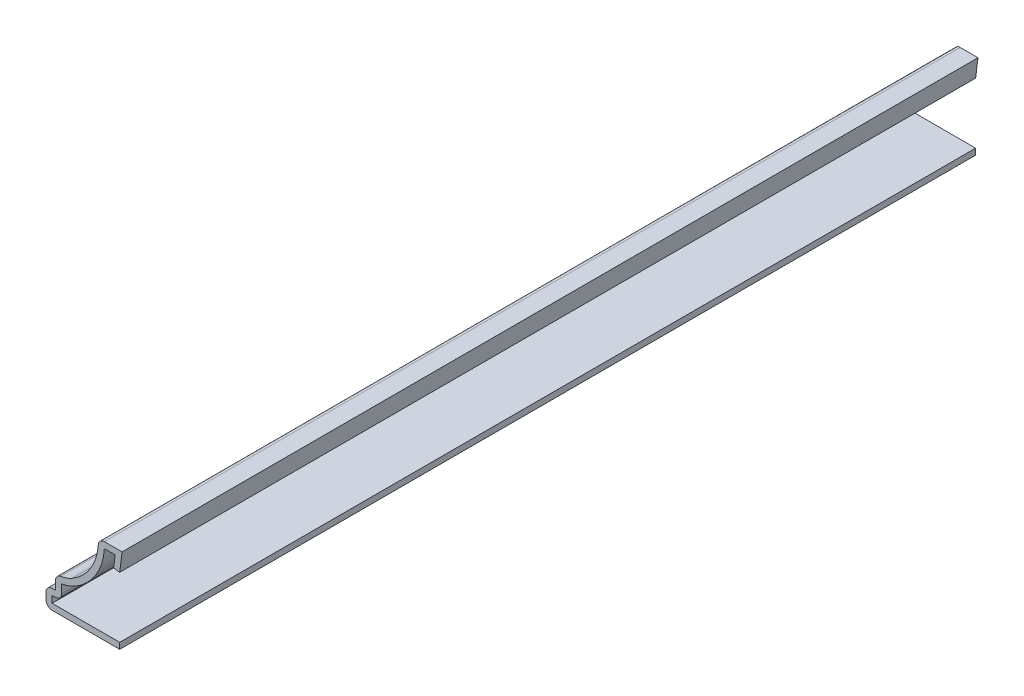
ISO-10303-21;
HEADER;
FILE_DESCRIPTION(('STEP AP214'),'2;1');
FILE_NAME('part.step','',(''),(''),'','','');
FILE_SCHEMA(('AUTOMOTIVE_DESIGN { 1 0 10303 214 1 1 1 1 }'));
ENDSEC;
DATA;
#1=APPLICATION_CONTEXT('core data for automotive mechanical design processes');
#2=APPLICATION_PROTOCOL_DEFINITION('international standard','automotive_design',2000,#1);
#3=PRODUCT_CONTEXT('',#1,'mechanical');
#4=PRODUCT('Part','Part','',(#3));
#5=PRODUCT_RELATED_PRODUCT_CATEGORY('part','',(#4));
#6=PRODUCT_DEFINITION_FORMATION('','',#4);
#7=PRODUCT_DEFINITION_CONTEXT('part definition',#1,'design');
#8=PRODUCT_DEFINITION('design','',#6,#7);
#9=PRODUCT_DEFINITION_SHAPE('','',#8);
#10=(LENGTH_UNIT() NAMED_UNIT(*) SI_UNIT(.MILLI.,.METRE.));
#11=(NAMED_UNIT(*) PLANE_ANGLE_UNIT() SI_UNIT($,.RADIAN.));
#12=(NAMED_UNIT(*) SI_UNIT($,.STERADIAN.) SOLID_ANGLE_UNIT());
#13=UNCERTAINTY_MEASURE_WITH_UNIT(LENGTH_MEASURE(1.E-05),#10,'distance_accuracy_value','');
#14=(GEOMETRIC_REPRESENTATION_CONTEXT(3) GLOBAL_UNCERTAINTY_ASSIGNED_CONTEXT((#13)) GLOBAL_UNIT_ASSIGNED_CONTEXT((#10,
#11,#12)) REPRESENTATION_CONTEXT('',''));
#15=CARTESIAN_POINT('',(0.,0.,0.));
#16=DIRECTION('',(0.,0.,1.));
#17=DIRECTION('',(1.,0.,0.));
#18=AXIS2_PLACEMENT_3D('',#15,#16,#17);
#19=CARTESIAN_POINT('',(-1.40490624951561,11.2644023452637,-142.875));
#20=DIRECTION('',(-0.992156741649221,0.125,0.));
#21=DIRECTION('',(-0.125,-0.992156741649222,0.));
#22=AXIS2_PLACEMENT_3D('',#19,#20,#21);
#23=PLANE('',#22);
#24=DIRECTION('',(-0.125,-0.992156741649221,0.));
#25=VECTOR('',#24,1.);
#26=CARTESIAN_POINT('',(-1.40490624951561,11.2644023452637,0.));
#27=LINE('',#26,#25);
#28=CARTESIAN_POINT('',(-1.15203571373212,13.2715,0.));
#29=VERTEX_POINT('',#28);
#30=CARTESIAN_POINT('',(-1.40490624951561,11.2644023452637,0.));
#31=VERTEX_POINT('',#30);
#32=EDGE_CURVE('E258',#29,#31,#27,.T.);
#33=ORIENTED_EDGE('',*,*,#32,.F.);
#34=DIRECTION('',(0.,0.,1.));
#35=VECTOR('',#34,1.);
#36=CARTESIAN_POINT('',(-1.15203571373212,13.2715,-142.875));
#37=LINE('',#36,#35);
#38=CARTESIAN_POINT('',(-1.15203571373212,13.2715,-142.875));
#39=VERTEX_POINT('',#38);
#40=EDGE_CURVE('E214',#39,#29,#37,.T.);
#41=ORIENTED_EDGE('',*,*,#40,.F.);
#42=DIRECTION('',(-0.125,-0.992156741649221,0.));
#43=VECTOR('',#42,1.);
#44=CARTESIAN_POINT('',(-1.40490624951561,11.2644023452637,-142.875));
#45=LINE('',#44,#43);
#46=CARTESIAN_POINT('',(-1.40490624951561,11.2644023452637,-142.875));
#47=VERTEX_POINT('',#46);
#48=EDGE_CURVE('E195',#39,#47,#45,.T.);
#49=ORIENTED_EDGE('',*,*,#48,.T.);
#50=DIRECTION('',(0.,0.,1.));
#51=VECTOR('',#50,1.);
#52=CARTESIAN_POINT('',(-1.40490624951561,11.2644023452637,-142.875));
#53=LINE('',#52,#51);
#54=EDGE_CURVE('E204',#47,#31,#53,.T.);
#55=ORIENTED_EDGE('',*,*,#54,.T.);
#56=EDGE_LOOP('',(#33,#41,#49,#55));
#57=FACE_BOUND('',#56,.T.);
#58=ADVANCED_FACE('F35',(#57),#23,.T.);
#59=CARTESIAN_POINT('',(0.,13.2715,-142.875));
#60=DIRECTION('',(0.,-1.,0.));
#61=DIRECTION('',(0.,0.,-1.));
#62=AXIS2_PLACEMENT_3D('',#59,#60,#61);
#63=PLANE('',#62);
#64=DIRECTION('',(1.,0.,0.));
#65=VECTOR('',#64,1.);
#66=CARTESIAN_POINT('',(0.,13.2715,0.));
#67=LINE('',#66,#65);
#68=CARTESIAN_POINT('',(-2.96092792350597,13.2715,0.));
#69=VERTEX_POINT('',#68);
#70=EDGE_CURVE('E215',#69,#29,#67,.T.);
#71=ORIENTED_EDGE('',*,*,#70,.F.);
#72=DIRECTION('',(0.,0.,1.));
#73=VECTOR('',#72,1.);
#74=CARTESIAN_POINT('',(-2.96092792350597,13.2715,-142.875));
#75=LINE('',#74,#73);
#76=CARTESIAN_POINT('',(-2.96092792350597,13.2715,-142.875));
#77=VERTEX_POINT('',#76);
#78=EDGE_CURVE('E300',#77,#69,#75,.T.);
#79=ORIENTED_EDGE('',*,*,#78,.F.);
#80=DIRECTION('',(1.,0.,0.));
#81=VECTOR('',#80,1.);
#82=CARTESIAN_POINT('',(0.,13.2715,-142.875));
#83=LINE('',#82,#81);
#84=EDGE_CURVE('E212',#77,#39,#83,.T.);
#85=ORIENTED_EDGE('',*,*,#84,.T.);
#86=ORIENTED_EDGE('',*,*,#40,.T.);
#87=EDGE_LOOP('',(#71,#79,#85,#86));
#88=FACE_BOUND('',#87,.T.);
#89=ADVANCED_FACE('F387',(#88),#63,.T.);
#90=CARTESIAN_POINT('',(-12.6899131848803,13.8679296659806,-142.875));
#91=DIRECTION('',(0.,0.,1.));
#92=DIRECTION('',(1.,0.,0.));
#93=AXIS2_PLACEMENT_3D('',#90,#91,#92);
#94=CYLINDRICAL_SURFACE('',#93,9.74725);
#95=CARTESIAN_POINT('',(-12.6899131848803,13.8679296659806,0.));
#96=DIRECTION('',(0.,0.,1.));
#97=DIRECTION('',(1.,0.,0.));
#98=AXIS2_PLACEMENT_3D('',#95,#96,#97);
#99=CIRCLE('',#98,9.74725);
#100=CARTESIAN_POINT('',(-7.84725470729787,5.40876059142018,0.));
#101=VERTEX_POINT('',#100);
#102=EDGE_CURVE('E218',#101,#69,#99,.T.);
#103=ORIENTED_EDGE('',*,*,#102,.F.);
#104=DIRECTION('',(0.,0.,1.));
#105=VECTOR('',#104,1.);
#106=CARTESIAN_POINT('',(-7.84725470729787,5.40876059142018,-142.875));
#107=LINE('',#106,#105);
#108=CARTESIAN_POINT('',(-7.84725470729787,5.40876059142018,-142.875));
#109=VERTEX_POINT('',#108);
#110=EDGE_CURVE('E302',#109,#101,#107,.T.);
#111=ORIENTED_EDGE('',*,*,#110,.F.);
#112=CARTESIAN_POINT('',(-12.6899131848803,13.8679296659806,-142.875));
#113=DIRECTION('',(0.,0.,1.));
#114=DIRECTION('',(1.,0.,0.));
#115=AXIS2_PLACEMENT_3D('',#112,#113,#114);
#116=CIRCLE('',#115,9.74725);
#117=EDGE_CURVE('E254',#109,#77,#116,.T.);
#118=ORIENTED_EDGE('',*,*,#117,.T.);
#119=ORIENTED_EDGE('',*,*,#78,.T.);
#120=EDGE_LOOP('',(#103,#111,#118,#119));
#121=FACE_BOUND('',#120,.T.);
#122=ADVANCED_FACE('F392',(#121),#94,.T.);
#123=CARTESIAN_POINT('',(-11.1125,11.1125,-142.875));
#124=DIRECTION('',(0.,0.,1.));
#125=DIRECTION('',(1.,0.,0.));
#126=AXIS2_PLACEMENT_3D('',#123,#124,#125);
#127=CYLINDRICAL_SURFACE('',#126,6.57225);
#128=CARTESIAN_POINT('',(-11.1125,11.1125,0.));
#129=DIRECTION('',(0.,0.,1.));
#130=DIRECTION('',(1.,0.,0.));
#131=AXIS2_PLACEMENT_3D('',#128,#129,#130);
#132=CIRCLE('',#131,6.57225);
#133=CARTESIAN_POINT('',(-10.0965,4.61925627575093,0.));
#134=VERTEX_POINT('',#133);
#135=EDGE_CURVE('E293',#134,#101,#132,.T.);
#136=ORIENTED_EDGE('',*,*,#135,.F.);
#137=DIRECTION('',(0.,0.,1.));
#138=VECTOR('',#137,1.);
#139=CARTESIAN_POINT('',(-10.0965,4.61925627575093,-142.875));
#140=LINE('',#139,#138);
#141=CARTESIAN_POINT('',(-10.0965,4.61925627575093,-142.875));
#142=VERTEX_POINT('',#141);
#143=EDGE_CURVE('E304',#142,#134,#140,.T.);
#144=ORIENTED_EDGE('',*,*,#143,.F.);
#145=CARTESIAN_POINT('',(-11.1125,11.1125,-142.875));
#146=DIRECTION('',(0.,0.,1.));
#147=DIRECTION('',(1.,0.,0.));
#148=AXIS2_PLACEMENT_3D('',#145,#146,#147);
#149=CIRCLE('',#148,6.57225);
#150=EDGE_CURVE('E251',#142,#109,#149,.T.);
#151=ORIENTED_EDGE('',*,*,#150,.T.);
#152=ORIENTED_EDGE('',*,*,#110,.T.);
#153=EDGE_LOOP('',(#136,#144,#151,#152));
#154=FACE_BOUND('',#153,.T.);
#155=ADVANCED_FACE('F464',(#154),#127,.T.);
#156=CARTESIAN_POINT('',(-10.0965,3.175,-142.875));
#157=DIRECTION('',(1.,0.,0.));
#158=DIRECTION('',(0.,0.,-1.));
#159=AXIS2_PLACEMENT_3D('',#156,#157,#158);
#160=PLANE('',#159);
#161=DIRECTION('',(0.,1.,0.));
#162=VECTOR('',#161,1.);
#163=CARTESIAN_POINT('',(-10.0965,3.175,0.));
#164=LINE('',#163,#162);
#165=CARTESIAN_POINT('',(-10.0965,3.175,0.));
#166=VERTEX_POINT('',#165);
#167=EDGE_CURVE('E291',#166,#134,#164,.T.);
#168=ORIENTED_EDGE('',*,*,#167,.F.);
#169=DIRECTION('',(0.,0.,1.));
#170=VECTOR('',#169,1.);
#171=CARTESIAN_POINT('',(-10.0965,3.175,-142.875));
#172=LINE('',#171,#170);
#173=CARTESIAN_POINT('',(-10.0965,3.175,-142.875));
#174=VERTEX_POINT('',#173);
#175=EDGE_CURVE('E357',#166,#174,#172,.F.);
#176=ORIENTED_EDGE('',*,*,#175,.T.);
#177=DIRECTION('',(0.,1.,0.));
#178=VECTOR('',#177,1.);
#179=CARTESIAN_POINT('',(-10.0965,3.175,-142.875));
#180=LINE('',#179,#178);
#181=EDGE_CURVE('E249',#174,#142,#180,.T.);
#182=ORIENTED_EDGE('',*,*,#181,.T.);
#183=ORIENTED_EDGE('',*,*,#143,.T.);
#184=EDGE_LOOP('',(#168,#176,#182,#183));
#185=FACE_BOUND('',#184,.T.);
#186=ADVANCED_FACE('F460',(#185),#160,.T.);
#187=CARTESIAN_POINT('',(-12.7,2.159,-142.875));
#188=DIRECTION('',(0.,-1.,0.));
#189=DIRECTION('',(0.,0.,-1.));
#190=AXIS2_PLACEMENT_3D('',#187,#188,#189);
#191=PLANE('',#190);
#192=DIRECTION('',(1.,0.,0.));
#193=VECTOR('',#192,1.);
#194=CARTESIAN_POINT('',(-12.7,2.159,-142.875));
#195=LINE('',#194,#193);
#196=CARTESIAN_POINT('',(-11.684,2.159,-142.875));
#197=VERTEX_POINT('',#196);
#198=CARTESIAN_POINT('',(-11.1125,2.159,-142.875));
#199=VERTEX_POINT('',#198);
#200=EDGE_CURVE('E246',#197,#199,#195,.T.);
#201=ORIENTED_EDGE('',*,*,#200,.T.);
#202=DIRECTION('',(0.,0.,1.));
#203=VECTOR('',#202,1.);
#204=CARTESIAN_POINT('',(-11.1125,2.159,-142.875));
#205=LINE('',#204,#203);
#206=CARTESIAN_POINT('',(-11.1125,2.159,0.));
#207=VERTEX_POINT('',#206);
#208=EDGE_CURVE('E354',#199,#207,#205,.T.);
#209=ORIENTED_EDGE('',*,*,#208,.T.);
#210=DIRECTION('',(1.,0.,0.));
#211=VECTOR('',#210,1.);
#212=CARTESIAN_POINT('',(-12.7,2.159,0.));
#213=LINE('',#212,#211);
#214=CARTESIAN_POINT('',(-11.684,2.159,0.));
#215=VERTEX_POINT('',#214);
#216=EDGE_CURVE('E288',#215,#207,#213,.T.);
#217=ORIENTED_EDGE('',*,*,#216,.F.);
#218=DIRECTION('',(0.,0.,1.));
#219=VECTOR('',#218,1.);
#220=CARTESIAN_POINT('',(-11.684,2.159,-142.875));
#221=LINE('',#220,#219);
#222=EDGE_CURVE('E307',#197,#215,#221,.T.);
#223=ORIENTED_EDGE('',*,*,#222,.F.);
#224=EDGE_LOOP('',(#201,#209,#217,#223));
#225=FACE_BOUND('',#224,.T.);
#226=ADVANCED_FACE('F456',(#225),#191,.T.);
#227=CARTESIAN_POINT('',(-11.684,0.,-142.875));
#228=DIRECTION('',(1.,0.,0.));
#229=DIRECTION('',(0.,0.,-1.));
#230=AXIS2_PLACEMENT_3D('',#227,#228,#229);
#231=PLANE('',#230);
#232=DIRECTION('',(0.,1.,0.));
#233=VECTOR('',#232,1.);
#234=CARTESIAN_POINT('',(-11.684,0.,0.));
#235=LINE('',#234,#233);
#236=CARTESIAN_POINT('',(-11.684,1.016,0.));
#237=VERTEX_POINT('',#236);
#238=EDGE_CURVE('E285',#237,#215,#235,.T.);
#239=ORIENTED_EDGE('',*,*,#238,.F.);
#240=DIRECTION('',(0.,0.,1.));
#241=VECTOR('',#240,1.);
#242=CARTESIAN_POINT('',(-11.684,1.016,-142.875));
#243=LINE('',#242,#241);
#244=CARTESIAN_POINT('',(-11.684,1.016,-142.875));
#245=VERTEX_POINT('',#244);
#246=EDGE_CURVE('E309',#245,#237,#243,.T.);
#247=ORIENTED_EDGE('',*,*,#246,.F.);
#248=DIRECTION('',(0.,1.,0.));
#249=VECTOR('',#248,1.);
#250=CARTESIAN_POINT('',(-11.684,0.,-142.875));
#251=LINE('',#250,#249);
#252=EDGE_CURVE('E243',#245,#197,#251,.T.);
#253=ORIENTED_EDGE('',*,*,#252,.T.);
#254=ORIENTED_EDGE('',*,*,#222,.T.);
#255=EDGE_LOOP('',(#239,#247,#253,#254));
#256=FACE_BOUND('',#255,.T.);
#257=ADVANCED_FACE('F452',(#256),#231,.T.);
#258=CARTESIAN_POINT('',(-0.396875,1.016,-142.875));
#259=DIRECTION('',(0.,1.,0.));
#260=DIRECTION('',(-1.,0.,0.));
#261=AXIS2_PLACEMENT_3D('',#258,#259,#260);
#262=PLANE('',#261);
#263=DIRECTION('',(-1.,0.,0.));
#264=VECTOR('',#263,1.);
#265=CARTESIAN_POINT('',(-0.396875,1.016,0.));
#266=LINE('',#265,#264);
#267=CARTESIAN_POINT('',(-0.396875,1.016,0.));
#268=VERTEX_POINT('',#267);
#269=EDGE_CURVE('E282',#268,#237,#266,.T.);
#270=ORIENTED_EDGE('',*,*,#269,.F.);
#271=DIRECTION('',(0.,0.,1.));
#272=VECTOR('',#271,1.);
#273=CARTESIAN_POINT('',(-0.396875,1.016,-142.875));
#274=LINE('',#273,#272);
#275=CARTESIAN_POINT('',(-0.396875,1.016,-142.875));
#276=VERTEX_POINT('',#275);
#277=EDGE_CURVE('E311',#276,#268,#274,.T.);
#278=ORIENTED_EDGE('',*,*,#277,.F.);
#279=DIRECTION('',(-1.,0.,0.));
#280=VECTOR('',#279,1.);
#281=CARTESIAN_POINT('',(-0.396875,1.016,-142.875));
#282=LINE('',#281,#280);
#283=EDGE_CURVE('E240',#276,#245,#282,.T.);
#284=ORIENTED_EDGE('',*,*,#283,.T.);
#285=ORIENTED_EDGE('',*,*,#246,.T.);
#286=EDGE_LOOP('',(#270,#278,#284,#285));
#287=FACE_BOUND('',#286,.T.);
#288=ADVANCED_FACE('F448',(#287),#262,.T.);
#289=CARTESIAN_POINT('',(-0.396875,1.016,-142.875));
#290=DIRECTION('',(-1.,0.,0.));
#291=DIRECTION('',(0.,-1.,0.));
#292=AXIS2_PLACEMENT_3D('',#289,#290,#291);
#293=PLANE('',#292);
#294=DIRECTION('',(0.,-1.,0.));
#295=VECTOR('',#294,1.);
#296=CARTESIAN_POINT('',(-0.396875,1.016,0.));
#297=LINE('',#296,#295);
#298=CARTESIAN_POINT('',(-0.396875,0.,0.));
#299=VERTEX_POINT('',#298);
#300=EDGE_CURVE('E280',#268,#299,#297,.T.);
#301=ORIENTED_EDGE('',*,*,#300,.T.);
#302=DIRECTION('',(0.,0.,1.));
#303=VECTOR('',#302,1.);
#304=CARTESIAN_POINT('',(-0.396875,0.,-142.875));
#305=LINE('',#304,#303);
#306=CARTESIAN_POINT('',(-0.396875,0.,-142.875));
#307=VERTEX_POINT('',#306);
#308=EDGE_CURVE('E313',#307,#299,#305,.T.);
#309=ORIENTED_EDGE('',*,*,#308,.F.);
#310=DIRECTION('',(0.,-1.,0.));
#311=VECTOR('',#310,1.);
#312=CARTESIAN_POINT('',(-0.396875,1.016,-142.875));
#313=LINE('',#312,#311);
#314=EDGE_CURVE('E238',#276,#307,#313,.T.);
#315=ORIENTED_EDGE('',*,*,#314,.F.);
#316=ORIENTED_EDGE('',*,*,#277,.T.);
#317=EDGE_LOOP('',(#301,#309,#315,#316));
#318=FACE_BOUND('',#317,.T.);
#319=ADVANCED_FACE('F444',(#318),#293,.F.);
#320=CARTESIAN_POINT('',(-0.396875,0.,-142.875));
#321=DIRECTION('',(0.,1.,0.));
#322=DIRECTION('',(-1.,0.,0.));
#323=AXIS2_PLACEMENT_3D('',#320,#321,#322);
#324=PLANE('',#323);
#325=DIRECTION('',(-1.,0.,0.));
#326=VECTOR('',#325,1.);
#327=CARTESIAN_POINT('',(-0.396875,0.,0.));
#328=LINE('',#327,#326);
#329=CARTESIAN_POINT('',(-11.684,0.,0.));
#330=VERTEX_POINT('',#329);
#331=EDGE_CURVE('E277',#299,#330,#328,.T.);
#332=ORIENTED_EDGE('',*,*,#331,.T.);
#333=DIRECTION('',(0.,0.,1.));
#334=VECTOR('',#333,1.);
#335=CARTESIAN_POINT('',(-11.684,0.,-142.875));
#336=LINE('',#335,#334);
#337=CARTESIAN_POINT('',(-11.684,0.,-142.875));
#338=VERTEX_POINT('',#337);
#339=EDGE_CURVE('E340',#330,#338,#336,.F.);
#340=ORIENTED_EDGE('',*,*,#339,.T.);
#341=DIRECTION('',(-1.,0.,0.));
#342=VECTOR('',#341,1.);
#343=CARTESIAN_POINT('',(-0.396875,0.,-142.875));
#344=LINE('',#343,#342);
#345=EDGE_CURVE('E236',#307,#338,#344,.T.);
#346=ORIENTED_EDGE('',*,*,#345,.F.);
#347=ORIENTED_EDGE('',*,*,#308,.T.);
#348=EDGE_LOOP('',(#332,#340,#346,#347));
#349=FACE_BOUND('',#348,.T.);
#350=ADVANCED_FACE('F440',(#349),#324,.F.);
#351=CARTESIAN_POINT('',(-12.7,0.,-142.875));
#352=DIRECTION('',(1.,0.,0.));
#353=DIRECTION('',(0.,0.,-1.));
#354=AXIS2_PLACEMENT_3D('',#351,#352,#353);
#355=PLANE('',#354);
#356=DIRECTION('',(0.,1.,0.));
#357=VECTOR('',#356,1.);
#358=CARTESIAN_POINT('',(-12.7,0.,-142.875));
#359=LINE('',#358,#357);
#360=CARTESIAN_POINT('',(-12.7,1.016,-142.875));
#361=VERTEX_POINT('',#360);
#362=CARTESIAN_POINT('',(-12.7,2.159,-142.875));
#363=VERTEX_POINT('',#362);
#364=EDGE_CURVE('E233',#361,#363,#359,.T.);
#365=ORIENTED_EDGE('',*,*,#364,.F.);
#366=DIRECTION('',(0.,0.,1.));
#367=VECTOR('',#366,1.);
#368=CARTESIAN_POINT('',(-12.7,1.016,-142.875));
#369=LINE('',#368,#367);
#370=CARTESIAN_POINT('',(-12.7,1.016,0.));
#371=VERTEX_POINT('',#370);
#372=EDGE_CURVE('E327',#361,#371,#369,.T.);
#373=ORIENTED_EDGE('',*,*,#372,.T.);
#374=DIRECTION('',(0.,1.,0.));
#375=VECTOR('',#374,1.);
#376=CARTESIAN_POINT('',(-12.7,0.,0.));
#377=LINE('',#376,#375);
#378=CARTESIAN_POINT('',(-12.7,2.159,0.));
#379=VERTEX_POINT('',#378);
#380=EDGE_CURVE('E274',#371,#379,#377,.T.);
#381=ORIENTED_EDGE('',*,*,#380,.T.);
#382=DIRECTION('',(0.,0.,1.));
#383=VECTOR('',#382,1.);
#384=CARTESIAN_POINT('',(-12.7,2.159,-142.875));
#385=LINE('',#384,#383);
#386=EDGE_CURVE('E299',#379,#363,#385,.F.);
#387=ORIENTED_EDGE('',*,*,#386,.T.);
#388=EDGE_LOOP('',(#365,#373,#381,#387));
#389=FACE_BOUND('',#388,.T.);
#390=ADVANCED_FACE('F436',(#389),#355,.F.);
#391=CARTESIAN_POINT('',(-12.7,3.175,-142.875));
#392=DIRECTION('',(0.,-1.,0.));
#393=DIRECTION('',(0.,0.,-1.));
#394=AXIS2_PLACEMENT_3D('',#391,#392,#393);
#395=PLANE('',#394);
#396=DIRECTION('',(1.,0.,0.));
#397=VECTOR('',#396,1.);
#398=CARTESIAN_POINT('',(-12.7,3.175,-142.875));
#399=LINE('',#398,#397);
#400=CARTESIAN_POINT('',(-11.684,3.175,-142.875));
#401=VERTEX_POINT('',#400);
#402=CARTESIAN_POINT('',(-11.1125,3.175,-142.875));
#403=VERTEX_POINT('',#402);
#404=EDGE_CURVE('E231',#401,#403,#399,.T.);
#405=ORIENTED_EDGE('',*,*,#404,.F.);
#406=DIRECTION('',(0.,0.,1.));
#407=VECTOR('',#406,1.);
#408=CARTESIAN_POINT('',(-11.684,3.175,-142.875));
#409=LINE('',#408,#407);
#410=CARTESIAN_POINT('',(-11.684,3.175,0.));
#411=VERTEX_POINT('',#410);
#412=EDGE_CURVE('E351',#401,#411,#409,.T.);
#413=ORIENTED_EDGE('',*,*,#412,.T.);
#414=DIRECTION('',(1.,0.,0.));
#415=VECTOR('',#414,1.);
#416=CARTESIAN_POINT('',(-12.7,3.175,0.));
#417=LINE('',#416,#415);
#418=CARTESIAN_POINT('',(-11.1125,3.175,0.));
#419=VERTEX_POINT('',#418);
#420=EDGE_CURVE('E272',#411,#419,#417,.T.);
#421=ORIENTED_EDGE('',*,*,#420,.T.);
#422=DIRECTION('',(0.,0.,1.));
#423=VECTOR('',#422,1.);
#424=CARTESIAN_POINT('',(-11.1125,3.175,-142.875));
#425=LINE('',#424,#423);
#426=EDGE_CURVE('E316',#403,#419,#425,.T.);
#427=ORIENTED_EDGE('',*,*,#426,.F.);
#428=EDGE_LOOP('',(#405,#413,#421,#427));
#429=FACE_BOUND('',#428,.T.);
#430=ADVANCED_FACE('F432',(#429),#395,.F.);
#431=CARTESIAN_POINT('',(-11.1125,3.175,-142.875));
#432=DIRECTION('',(1.,0.,0.));
#433=DIRECTION('',(0.,0.,-1.));
#434=AXIS2_PLACEMENT_3D('',#431,#432,#433);
#435=PLANE('',#434);
#436=DIRECTION('',(0.,1.,0.));
#437=VECTOR('',#436,1.);
#438=CARTESIAN_POINT('',(-11.1125,3.175,0.));
#439=LINE('',#438,#437);
#440=CARTESIAN_POINT('',(-11.1125,4.61925627575093,0.));
#441=VERTEX_POINT('',#440);
#442=EDGE_CURVE('E269',#419,#441,#439,.T.);
#443=ORIENTED_EDGE('',*,*,#442,.T.);
#444=DIRECTION('',(0.,0.,1.));
#445=VECTOR('',#444,1.);
#446=CARTESIAN_POINT('',(-11.1125,4.61925627575093,-142.875));
#447=LINE('',#446,#445);
#448=CARTESIAN_POINT('',(-11.1125,4.61925627575093,-142.875));
#449=VERTEX_POINT('',#448);
#450=EDGE_CURVE('E362',#441,#449,#447,.F.);
#451=ORIENTED_EDGE('',*,*,#450,.T.);
#452=DIRECTION('',(0.,1.,0.));
#453=VECTOR('',#452,1.);
#454=CARTESIAN_POINT('',(-11.1125,3.175,-142.875));
#455=LINE('',#454,#453);
#456=EDGE_CURVE('E228',#403,#449,#455,.T.);
#457=ORIENTED_EDGE('',*,*,#456,.F.);
#458=ORIENTED_EDGE('',*,*,#426,.T.);
#459=EDGE_LOOP('',(#443,#451,#457,#458));
#460=FACE_BOUND('',#459,.T.);
#461=ADVANCED_FACE('F427',(#460),#435,.F.);
#462=CARTESIAN_POINT('',(-11.1125,11.1125,-142.875));
#463=DIRECTION('',(0.,0.,1.));
#464=DIRECTION('',(1.,0.,0.));
#465=AXIS2_PLACEMENT_3D('',#462,#463,#464);
#466=CYLINDRICAL_SURFACE('',#465,5.55625);
#467=CARTESIAN_POINT('',(-11.1125,11.1125,-142.875));
#468=DIRECTION('',(0.,0.,1.));
#469=DIRECTION('',(1.,0.,0.));
#470=AXIS2_PLACEMENT_3D('',#467,#468,#469);
#471=CIRCLE('',#470,5.55625);
#472=CARTESIAN_POINT('',(-10.2535628019324,5.62304274520006,-142.875));
#473=VERTEX_POINT('',#472);
#474=CARTESIAN_POINT('',(-8.35202692645955,6.29049808453397,-142.875));
#475=VERTEX_POINT('',#474);
#476=EDGE_CURVE('E226',#473,#475,#471,.T.);
#477=ORIENTED_EDGE('',*,*,#476,.F.);
#478=DIRECTION('',(0.,0.,1.));
#479=VECTOR('',#478,1.);
#480=CARTESIAN_POINT('',(-10.2535628019324,5.62304274520006,-142.875));
#481=LINE('',#480,#479);
#482=CARTESIAN_POINT('',(-10.2535628019324,5.62304274520006,0.));
#483=VERTEX_POINT('',#482);
#484=EDGE_CURVE('E359',#473,#483,#481,.T.);
#485=ORIENTED_EDGE('',*,*,#484,.T.);
#486=CARTESIAN_POINT('',(-11.1125,11.1125,0.));
#487=DIRECTION('',(0.,0.,1.));
#488=DIRECTION('',(1.,0.,0.));
#489=AXIS2_PLACEMENT_3D('',#486,#487,#488);
#490=CIRCLE('',#489,5.55625);
#491=CARTESIAN_POINT('',(-8.35202692645955,6.29049808453397,0.));
#492=VERTEX_POINT('',#491);
#493=EDGE_CURVE('E267',#483,#492,#490,.T.);
#494=ORIENTED_EDGE('',*,*,#493,.T.);
#495=DIRECTION('',(0.,0.,1.));
#496=VECTOR('',#495,1.);
#497=CARTESIAN_POINT('',(-8.35202692645955,6.29049808453397,-142.875));
#498=LINE('',#497,#496);
#499=EDGE_CURVE('E319',#475,#492,#498,.T.);
#500=ORIENTED_EDGE('',*,*,#499,.F.);
#501=EDGE_LOOP('',(#477,#485,#494,#500));
#502=FACE_BOUND('',#501,.T.);
#503=ADVANCED_FACE('F420',(#502),#466,.F.);
#504=CARTESIAN_POINT('',(-12.6899131848803,13.8679296659806,-142.875));
#505=DIRECTION('',(0.,0.,1.));
#506=DIRECTION('',(1.,0.,0.));
#507=AXIS2_PLACEMENT_3D('',#504,#505,#506);
#508=CYLINDRICAL_SURFACE('',#507,8.73125);
#509=CARTESIAN_POINT('',(-12.6899131848803,13.8679296659806,0.));
#510=DIRECTION('',(0.,0.,1.));
#511=DIRECTION('',(-1.,0.,0.));
#512=AXIS2_PLACEMENT_3D('',#509,#510,#511);
#513=CIRCLE('',#512,8.73125);
#514=CARTESIAN_POINT('',(-3.97502410710199,13.3336685645322,0.));
#515=VERTEX_POINT('',#514);
#516=EDGE_CURVE('E265',#492,#515,#513,.T.);
#517=ORIENTED_EDGE('',*,*,#516,.T.);
#518=DIRECTION('',(0.,0.,1.));
#519=VECTOR('',#518,1.);
#520=CARTESIAN_POINT('',(-3.97502410710199,13.3336685645322,-142.875));
#521=LINE('',#520,#519);
#522=CARTESIAN_POINT('',(-3.97502410710199,13.3336685645322,-142.875));
#523=VERTEX_POINT('',#522);
#524=EDGE_CURVE('E11',#515,#523,#521,.F.);
#525=ORIENTED_EDGE('',*,*,#524,.T.);
#526=CARTESIAN_POINT('',(-12.6899131848803,13.8679296659806,-142.875));
#527=DIRECTION('',(0.,0.,1.));
#528=DIRECTION('',(-1.,0.,0.));
#529=AXIS2_PLACEMENT_3D('',#526,#527,#528);
#530=CIRCLE('',#529,8.73125);
#531=EDGE_CURVE('E224',#475,#523,#530,.T.);
#532=ORIENTED_EDGE('',*,*,#531,.F.);
#533=ORIENTED_EDGE('',*,*,#499,.T.);
#534=EDGE_LOOP('',(#517,#525,#532,#533));
#535=FACE_BOUND('',#534,.T.);
#536=ADVANCED_FACE('F384',(#535),#508,.F.);
#537=CARTESIAN_POINT('',(0.,14.2875,-142.875));
#538=DIRECTION('',(0.,-1.,0.));
#539=DIRECTION('',(0.,0.,-1.));
#540=AXIS2_PLACEMENT_3D('',#537,#538,#539);
#541=PLANE('',#540);
#542=DIRECTION('',(1.,0.,0.));
#543=VECTOR('',#542,1.);
#544=CARTESIAN_POINT('',(0.,14.2875,-142.875));
#545=LINE('',#544,#543);
#546=CARTESIAN_POINT('',(-2.96092792350597,14.2875,-142.875));
#547=VERTEX_POINT('',#546);
#548=CARTESIAN_POINT('',(0.,14.2875,-142.875));
#549=VERTEX_POINT('',#548);
#550=EDGE_CURVE('E222',#547,#549,#545,.T.);
#551=ORIENTED_EDGE('',*,*,#550,.F.);
#552=DIRECTION('',(0.,0.,1.));
#553=VECTOR('',#552,1.);
#554=CARTESIAN_POINT('',(-2.96092792350597,14.2875,-142.875));
#555=LINE('',#554,#553);
#556=CARTESIAN_POINT('',(-2.96092792350597,14.2875,0.));
#557=VERTEX_POINT('',#556);
#558=EDGE_CURVE('E43',#547,#557,#555,.T.);
#559=ORIENTED_EDGE('',*,*,#558,.T.);
#560=DIRECTION('',(1.,0.,0.));
#561=VECTOR('',#560,1.);
#562=CARTESIAN_POINT('',(0.,14.2875,0.));
#563=LINE('',#562,#561);
#564=CARTESIAN_POINT('',(0.,14.2875,0.));
#565=VERTEX_POINT('',#564);
#566=EDGE_CURVE('E263',#557,#565,#563,.T.);
#567=ORIENTED_EDGE('',*,*,#566,.T.);
#568=DIRECTION('',(0.,0.,1.));
#569=VECTOR('',#568,1.);
#570=CARTESIAN_POINT('',(0.,14.2875,-142.875));
#571=LINE('',#570,#569);
#572=EDGE_CURVE('E322',#549,#565,#571,.T.);
#573=ORIENTED_EDGE('',*,*,#572,.F.);
#574=EDGE_LOOP('',(#551,#559,#567,#573));
#575=FACE_BOUND('',#574,.T.);
#576=ADVANCED_FACE('F367',(#575),#541,.F.);
#577=CARTESIAN_POINT('',(-0.396875,11.1374023452637,-142.875));
#578=DIRECTION('',(-0.992156741649221,0.125,0.));
#579=DIRECTION('',(-0.125,-0.992156741649222,0.));
#580=AXIS2_PLACEMENT_3D('',#577,#578,#579);
#581=PLANE('',#580);
#582=DIRECTION('',(-0.125,-0.992156741649221,0.));
#583=VECTOR('',#582,1.);
#584=CARTESIAN_POINT('',(-0.396875,11.1374023452637,0.));
#585=LINE('',#584,#583);
#586=CARTESIAN_POINT('',(-0.396875,11.1374023452637,0.));
#587=VERTEX_POINT('',#586);
#588=EDGE_CURVE('E261',#565,#587,#585,.T.);
#589=ORIENTED_EDGE('',*,*,#588,.T.);
#590=DIRECTION('',(0.,0.,1.));
#591=VECTOR('',#590,1.);
#592=CARTESIAN_POINT('',(-0.396875,11.1374023452637,-142.875));
#593=LINE('',#592,#591);
#594=CARTESIAN_POINT('',(-0.396875,11.1374023452637,-142.875));
#595=VERTEX_POINT('',#594);
#596=EDGE_CURVE('E211',#595,#587,#593,.T.);
#597=ORIENTED_EDGE('',*,*,#596,.F.);
#598=DIRECTION('',(-0.125,-0.992156741649221,0.));
#599=VECTOR('',#598,1.);
#600=CARTESIAN_POINT('',(-0.396875,11.1374023452637,-142.875));
#601=LINE('',#600,#599);
#602=EDGE_CURVE('E198',#549,#595,#601,.T.);
#603=ORIENTED_EDGE('',*,*,#602,.F.);
#604=ORIENTED_EDGE('',*,*,#572,.T.);
#605=EDGE_LOOP('',(#589,#597,#603,#604));
#606=FACE_BOUND('',#605,.T.);
#607=ADVANCED_FACE('F376',(#606),#581,.F.);
#608=CARTESIAN_POINT('',(-0.396875,11.1374023452637,-142.875));
#609=DIRECTION('',(0.125,0.992156741649221,0.));
#610=DIRECTION('',(-0.992156741649221,0.125,0.));
#611=AXIS2_PLACEMENT_3D('',#608,#609,#610);
#612=PLANE('',#611);
#613=DIRECTION('',(-0.992156741649221,0.125,0.));
#614=VECTOR('',#613,1.);
#615=CARTESIAN_POINT('',(-0.396875,11.1374023452637,0.));
#616=LINE('',#615,#614);
#617=EDGE_CURVE('E207',#587,#31,#616,.T.);
#618=ORIENTED_EDGE('',*,*,#617,.T.);
#619=ORIENTED_EDGE('',*,*,#54,.F.);
#620=DIRECTION('',(-0.992156741649221,0.125,0.));
#621=VECTOR('',#620,1.);
#622=CARTESIAN_POINT('',(-0.396875,11.1374023452637,-142.875));
#623=LINE('',#622,#621);
#624=EDGE_CURVE('E189',#595,#47,#623,.T.);
#625=ORIENTED_EDGE('',*,*,#624,.F.);
#626=ORIENTED_EDGE('',*,*,#596,.T.);
#627=EDGE_LOOP('',(#618,#619,#625,#626));
#628=FACE_BOUND('',#627,.T.);
#629=ADVANCED_FACE('F205',(#628),#612,.F.);
#630=CARTESIAN_POINT('',(-12.6899131848803,13.8679296659806,-142.875));
#631=DIRECTION('',(0.,0.,1.));
#632=DIRECTION('',(1.,0.,0.));
#633=AXIS2_PLACEMENT_3D('',#630,#631,#632);
#634=PLANE('',#633);
#635=ORIENTED_EDGE('',*,*,#345,.T.);
#636=CARTESIAN_POINT('',(-11.684,1.016,-142.875));
#637=DIRECTION('',(0.,0.,1.));
#638=DIRECTION('',(1.,0.,0.));
#639=AXIS2_PLACEMENT_3D('',#636,#637,#638);
#640=CIRCLE('',#639,1.016);
#641=EDGE_CURVE('E349',#338,#361,#640,.F.);
#642=ORIENTED_EDGE('',*,*,#641,.T.);
#643=ORIENTED_EDGE('',*,*,#364,.T.);
#644=CARTESIAN_POINT('',(-11.684,2.159,-142.875));
#645=DIRECTION('',(0.,0.,1.));
#646=DIRECTION('',(1.,0.,0.));
#647=AXIS2_PLACEMENT_3D('',#644,#645,#646);
#648=CIRCLE('',#647,1.016);
#649=EDGE_CURVE('E347',#363,#401,#648,.F.);
#650=ORIENTED_EDGE('',*,*,#649,.T.);
#651=ORIENTED_EDGE('',*,*,#404,.T.);
#652=ORIENTED_EDGE('',*,*,#456,.T.);
#653=CARTESIAN_POINT('',(-10.0965,4.61925627575093,-142.875));
#654=DIRECTION('',(0.,0.,1.));
#655=DIRECTION('',(1.,0.,0.));
#656=AXIS2_PLACEMENT_3D('',#653,#654,#655);
#657=CIRCLE('',#656,1.016);
#658=EDGE_CURVE('E343',#449,#473,#657,.F.);
#659=ORIENTED_EDGE('',*,*,#658,.T.);
#660=ORIENTED_EDGE('',*,*,#476,.T.);
#661=ORIENTED_EDGE('',*,*,#531,.T.);
#662=CARTESIAN_POINT('',(-2.96092792350597,13.2715,-142.875));
#663=DIRECTION('',(0.,0.,1.));
#664=DIRECTION('',(1.,0.,0.));
#665=AXIS2_PLACEMENT_3D('',#662,#663,#664);
#666=CIRCLE('',#665,1.016);
#667=EDGE_CURVE('E50',#523,#547,#666,.F.);
#668=ORIENTED_EDGE('',*,*,#667,.T.);
#669=ORIENTED_EDGE('',*,*,#550,.T.);
#670=ORIENTED_EDGE('',*,*,#602,.T.);
#671=ORIENTED_EDGE('',*,*,#624,.T.);
#672=ORIENTED_EDGE('',*,*,#48,.F.);
#673=ORIENTED_EDGE('',*,*,#84,.F.);
#674=ORIENTED_EDGE('',*,*,#117,.F.);
#675=ORIENTED_EDGE('',*,*,#150,.F.);
#676=ORIENTED_EDGE('',*,*,#181,.F.);
#677=CARTESIAN_POINT('',(-11.1125,3.175,-142.875));
#678=DIRECTION('',(0.,0.,1.));
#679=DIRECTION('',(1.,0.,0.));
#680=AXIS2_PLACEMENT_3D('',#677,#678,#679);
#681=CIRCLE('',#680,1.016);
#682=EDGE_CURVE('E345',#174,#199,#681,.F.);
#683=ORIENTED_EDGE('',*,*,#682,.T.);
#684=ORIENTED_EDGE('',*,*,#200,.F.);
#685=ORIENTED_EDGE('',*,*,#252,.F.);
#686=ORIENTED_EDGE('',*,*,#283,.F.);
#687=ORIENTED_EDGE('',*,*,#314,.T.);
#688=EDGE_LOOP('',(#635,#642,#643,#650,#651,#652,#659,#660,#661,#668,#669,#670,#671,#672,#673,
#674,#675,#676,#683,#684,#685,#686,#687));
#689=FACE_BOUND('',#688,.T.);
#690=ADVANCED_FACE('F192',(#689),#634,.F.);
#691=CARTESIAN_POINT('',(-12.6899131848803,13.8679296659806,0.));
#692=DIRECTION('',(0.,0.,1.));
#693=DIRECTION('',(1.,0.,0.));
#694=AXIS2_PLACEMENT_3D('',#691,#692,#693);
#695=PLANE('',#694);
#696=ORIENTED_EDGE('',*,*,#380,.F.);
#697=CARTESIAN_POINT('',(-11.684,1.016,0.));
#698=DIRECTION('',(0.,0.,1.));
#699=DIRECTION('',(1.,0.,0.));
#700=AXIS2_PLACEMENT_3D('',#697,#698,#699);
#701=CIRCLE('',#700,1.016);
#702=EDGE_CURVE('E338',#371,#330,#701,.T.);
#703=ORIENTED_EDGE('',*,*,#702,.T.);
#704=ORIENTED_EDGE('',*,*,#331,.F.);
#705=ORIENTED_EDGE('',*,*,#300,.F.);
#706=ORIENTED_EDGE('',*,*,#269,.T.);
#707=ORIENTED_EDGE('',*,*,#238,.T.);
#708=ORIENTED_EDGE('',*,*,#216,.T.);
#709=CARTESIAN_POINT('',(-11.1125,3.175,0.));
#710=DIRECTION('',(0.,0.,1.));
#711=DIRECTION('',(1.,0.,0.));
#712=AXIS2_PLACEMENT_3D('',#709,#710,#711);
#713=CIRCLE('',#712,1.016);
#714=EDGE_CURVE('E334',#207,#166,#713,.T.);
#715=ORIENTED_EDGE('',*,*,#714,.T.);
#716=ORIENTED_EDGE('',*,*,#167,.T.);
#717=ORIENTED_EDGE('',*,*,#135,.T.);
#718=ORIENTED_EDGE('',*,*,#102,.T.);
#719=ORIENTED_EDGE('',*,*,#70,.T.);
#720=ORIENTED_EDGE('',*,*,#32,.T.);
#721=ORIENTED_EDGE('',*,*,#617,.F.);
#722=ORIENTED_EDGE('',*,*,#588,.F.);
#723=ORIENTED_EDGE('',*,*,#566,.F.);
#724=CARTESIAN_POINT('',(-2.96092792350597,13.2715,0.));
#725=DIRECTION('',(0.,0.,1.));
#726=DIRECTION('',(1.,0.,0.));
#727=AXIS2_PLACEMENT_3D('',#724,#725,#726);
#728=CIRCLE('',#727,1.016);
#729=EDGE_CURVE('E330',#557,#515,#728,.T.);
#730=ORIENTED_EDGE('',*,*,#729,.T.);
#731=ORIENTED_EDGE('',*,*,#516,.F.);
#732=ORIENTED_EDGE('',*,*,#493,.F.);
#733=CARTESIAN_POINT('',(-10.0965,4.61925627575093,0.));
#734=DIRECTION('',(0.,0.,1.));
#735=DIRECTION('',(1.,0.,0.));
#736=AXIS2_PLACEMENT_3D('',#733,#734,#735);
#737=CIRCLE('',#736,1.016);
#738=EDGE_CURVE('E332',#483,#441,#737,.T.);
#739=ORIENTED_EDGE('',*,*,#738,.T.);
#740=ORIENTED_EDGE('',*,*,#442,.F.);
#741=ORIENTED_EDGE('',*,*,#420,.F.);
#742=CARTESIAN_POINT('',(-11.684,2.159,0.));
#743=DIRECTION('',(0.,0.,1.));
#744=DIRECTION('',(1.,0.,0.));
#745=AXIS2_PLACEMENT_3D('',#742,#743,#744);
#746=CIRCLE('',#745,1.016);
#747=EDGE_CURVE('E336',#411,#379,#746,.T.);
#748=ORIENTED_EDGE('',*,*,#747,.T.);
#749=EDGE_LOOP('',(#696,#703,#704,#705,#706,#707,#708,#715,#716,#717,#718,#719,#720,#721,#722,
#723,#730,#731,#732,#739,#740,#741,#748));
#750=FACE_BOUND('',#749,.T.);
#751=ADVANCED_FACE('F373',(#750),#695,.T.);
#752=CARTESIAN_POINT('',(-11.684,1.016,-142.875));
#753=DIRECTION('',(0.,0.,1.));
#754=DIRECTION('',(1.,0.,0.));
#755=AXIS2_PLACEMENT_3D('',#752,#753,#754);
#756=CYLINDRICAL_SURFACE('',#755,1.016);
#757=ORIENTED_EDGE('',*,*,#641,.F.);
#758=ORIENTED_EDGE('',*,*,#339,.F.);
#759=ORIENTED_EDGE('',*,*,#702,.F.);
#760=ORIENTED_EDGE('',*,*,#372,.F.);
#761=EDGE_LOOP('',(#757,#758,#759,#760));
#762=FACE_BOUND('',#761,.T.);
#763=ADVANCED_FACE('F396',(#762),#756,.T.);
#764=CARTESIAN_POINT('',(-11.684,2.159,-142.875));
#765=DIRECTION('',(0.,0.,1.));
#766=DIRECTION('',(1.,0.,0.));
#767=AXIS2_PLACEMENT_3D('',#764,#765,#766);
#768=CYLINDRICAL_SURFACE('',#767,1.016);
#769=ORIENTED_EDGE('',*,*,#649,.F.);
#770=ORIENTED_EDGE('',*,*,#386,.F.);
#771=ORIENTED_EDGE('',*,*,#747,.F.);
#772=ORIENTED_EDGE('',*,*,#412,.F.);
#773=EDGE_LOOP('',(#769,#770,#771,#772));
#774=FACE_BOUND('',#773,.T.);
#775=ADVANCED_FACE('F399',(#774),#768,.T.);
#776=CARTESIAN_POINT('',(-11.1125,3.175,-142.875));
#777=DIRECTION('',(0.,0.,1.));
#778=DIRECTION('',(1.,0.,0.));
#779=AXIS2_PLACEMENT_3D('',#776,#777,#778);
#780=CYLINDRICAL_SURFACE('',#779,1.016);
#781=ORIENTED_EDGE('',*,*,#682,.F.);
#782=ORIENTED_EDGE('',*,*,#175,.F.);
#783=ORIENTED_EDGE('',*,*,#714,.F.);
#784=ORIENTED_EDGE('',*,*,#208,.F.);
#785=EDGE_LOOP('',(#781,#782,#783,#784));
#786=FACE_BOUND('',#785,.T.);
#787=ADVANCED_FACE('F403',(#786),#780,.T.);
#788=CARTESIAN_POINT('',(-10.0965,4.61925627575093,-142.875));
#789=DIRECTION('',(0.,0.,1.));
#790=DIRECTION('',(1.,0.,0.));
#791=AXIS2_PLACEMENT_3D('',#788,#789,#790);
#792=CYLINDRICAL_SURFACE('',#791,1.016);
#793=ORIENTED_EDGE('',*,*,#658,.F.);
#794=ORIENTED_EDGE('',*,*,#450,.F.);
#795=ORIENTED_EDGE('',*,*,#738,.F.);
#796=ORIENTED_EDGE('',*,*,#484,.F.);
#797=EDGE_LOOP('',(#793,#794,#795,#796));
#798=FACE_BOUND('',#797,.T.);
#799=ADVANCED_FACE('F406',(#798),#792,.T.);
#800=CARTESIAN_POINT('',(-2.96092792350597,13.2715,-142.875));
#801=DIRECTION('',(0.,0.,1.));
#802=DIRECTION('',(1.,0.,0.));
#803=AXIS2_PLACEMENT_3D('',#800,#801,#802);
#804=CYLINDRICAL_SURFACE('',#803,1.016);
#805=ORIENTED_EDGE('',*,*,#667,.F.);
#806=ORIENTED_EDGE('',*,*,#524,.F.);
#807=ORIENTED_EDGE('',*,*,#729,.F.);
#808=ORIENTED_EDGE('',*,*,#558,.F.);
#809=EDGE_LOOP('',(#805,#806,#807,#808));
#810=FACE_BOUND('',#809,.T.);
#811=ADVANCED_FACE('F37',(#810),#804,.T.);
#812=CLOSED_SHELL('',(#58,#89,#122,#155,#186,#226,#257,#288,#319,#350,#390,#430,#461,#503,#536,
#576,#607,#629,#690,#751,#763,#775,#787,#799,#811));
#813=MANIFOLD_SOLID_BREP('B2',#812);
#814=ADVANCED_BREP_SHAPE_REPRESENTATION('',(#18,#813),#14);
#815=SHAPE_DEFINITION_REPRESENTATION(#9,#814);
ENDSEC;
END-ISO-10303-21;
